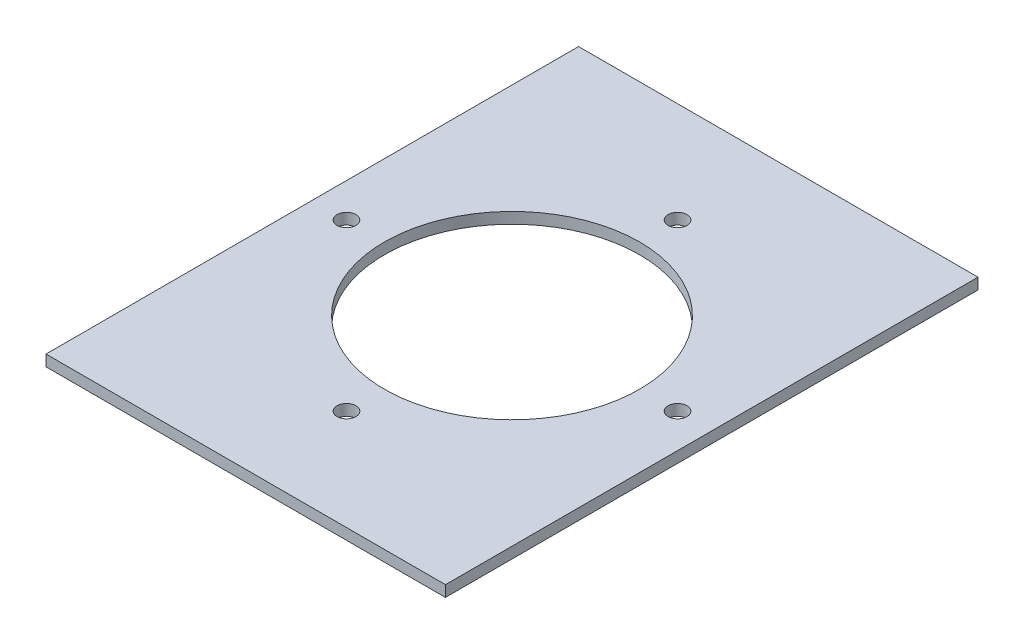
ISO-10303-21;
HEADER;
FILE_DESCRIPTION(('STEP AP214'),'2;1');
FILE_NAME('part.step','',(''),(''),'','','');
FILE_SCHEMA(('AUTOMOTIVE_DESIGN { 1 0 10303 214 1 1 1 1 }'));
ENDSEC;
DATA;
#1=APPLICATION_CONTEXT('core data for automotive mechanical design processes');
#2=APPLICATION_PROTOCOL_DEFINITION('international standard','automotive_design',2000,#1);
#3=PRODUCT_CONTEXT('',#1,'mechanical');
#4=PRODUCT('Part','Part','',(#3));
#5=PRODUCT_RELATED_PRODUCT_CATEGORY('part','',(#4));
#6=PRODUCT_DEFINITION_FORMATION('','',#4);
#7=PRODUCT_DEFINITION_CONTEXT('part definition',#1,'design');
#8=PRODUCT_DEFINITION('design','',#6,#7);
#9=PRODUCT_DEFINITION_SHAPE('','',#8);
#10=(LENGTH_UNIT() NAMED_UNIT(*) SI_UNIT(.MILLI.,.METRE.));
#11=(NAMED_UNIT(*) PLANE_ANGLE_UNIT() SI_UNIT($,.RADIAN.));
#12=(NAMED_UNIT(*) SI_UNIT($,.STERADIAN.) SOLID_ANGLE_UNIT());
#13=UNCERTAINTY_MEASURE_WITH_UNIT(LENGTH_MEASURE(1.E-05),#10,'distance_accuracy_value','');
#14=(GEOMETRIC_REPRESENTATION_CONTEXT(3) GLOBAL_UNCERTAINTY_ASSIGNED_CONTEXT((#13)) GLOBAL_UNIT_ASSIGNED_CONTEXT((#10,
#11,#12)) REPRESENTATION_CONTEXT('',''));
#15=CARTESIAN_POINT('',(0.,0.,0.));
#16=DIRECTION('',(0.,0.,1.));
#17=DIRECTION('',(1.,0.,0.));
#18=AXIS2_PLACEMENT_3D('',#15,#16,#17);
#19=CARTESIAN_POINT('',(0.,5.,0.));
#20=DIRECTION('',(0.,-1.,0.));
#21=DIRECTION('',(0.,0.,-1.));
#22=AXIS2_PLACEMENT_3D('',#19,#20,#21);
#23=PLANE('',#22);
#24=CARTESIAN_POINT('',(0.,5.,0.));
#25=DIRECTION('',(0.,-1.,0.));
#26=DIRECTION('',(0.,0.,-1.));
#27=AXIS2_PLACEMENT_3D('',#24,#25,#26);
#28=CIRCLE('',#27,57.5);
#29=CARTESIAN_POINT('',(0.,5.,-57.5));
#30=VERTEX_POINT('',#29);
#31=EDGE_CURVE('E114',#30,#30,#28,.F.);
#32=ORIENTED_EDGE('',*,*,#31,.F.);
#33=EDGE_LOOP('',(#32));
#34=FACE_BOUND('',#33,.T.);
#35=CARTESIAN_POINT('',(0.,5.,-74.6));
#36=DIRECTION('',(0.,-1.,0.));
#37=DIRECTION('',(0.,0.,-1.));
#38=AXIS2_PLACEMENT_3D('',#35,#36,#37);
#39=CIRCLE('',#38,4.25000000000001);
#40=CARTESIAN_POINT('',(0.,5.,-78.85));
#41=VERTEX_POINT('',#40);
#42=EDGE_CURVE('E137',#41,#41,#39,.F.);
#43=ORIENTED_EDGE('',*,*,#42,.F.);
#44=EDGE_LOOP('',(#43));
#45=FACE_BOUND('',#44,.T.);
#46=DIRECTION('',(0.,0.,1.));
#47=VECTOR('',#46,1.);
#48=CARTESIAN_POINT('',(-90.,5.,120.));
#49=LINE('',#48,#47);
#50=CARTESIAN_POINT('',(-90.,5.,-120.));
#51=VERTEX_POINT('',#50);
#52=CARTESIAN_POINT('',(-90.,5.,120.));
#53=VERTEX_POINT('',#52);
#54=EDGE_CURVE('E93',#51,#53,#49,.T.);
#55=ORIENTED_EDGE('',*,*,#54,.T.);
#56=DIRECTION('',(1.,0.,0.));
#57=VECTOR('',#56,1.);
#58=CARTESIAN_POINT('',(-90.,5.,120.));
#59=LINE('',#58,#57);
#60=CARTESIAN_POINT('',(90.,5.,120.));
#61=VERTEX_POINT('',#60);
#62=EDGE_CURVE('E88',#53,#61,#59,.T.);
#63=ORIENTED_EDGE('',*,*,#62,.T.);
#64=DIRECTION('',(0.,0.,-1.));
#65=VECTOR('',#64,1.);
#66=CARTESIAN_POINT('',(90.,5.,120.));
#67=LINE('',#66,#65);
#68=CARTESIAN_POINT('',(90.,5.,-120.));
#69=VERTEX_POINT('',#68);
#70=EDGE_CURVE('E91',#61,#69,#67,.T.);
#71=ORIENTED_EDGE('',*,*,#70,.T.);
#72=DIRECTION('',(-1.,0.,0.));
#73=VECTOR('',#72,1.);
#74=CARTESIAN_POINT('',(-90.,5.,-120.));
#75=LINE('',#74,#73);
#76=EDGE_CURVE('E58',#69,#51,#75,.T.);
#77=ORIENTED_EDGE('',*,*,#76,.T.);
#78=EDGE_LOOP('',(#55,#63,#71,#77));
#79=FACE_BOUND('',#78,.T.);
#80=CARTESIAN_POINT('',(0.,5.,74.6));
#81=DIRECTION('',(0.,-1.,0.));
#82=DIRECTION('',(0.,0.,-1.));
#83=AXIS2_PLACEMENT_3D('',#80,#81,#82);
#84=CIRCLE('',#83,4.25000000000001);
#85=CARTESIAN_POINT('',(0.,5.,70.35));
#86=VERTEX_POINT('',#85);
#87=EDGE_CURVE('E157',#86,#86,#84,.F.);
#88=ORIENTED_EDGE('',*,*,#87,.F.);
#89=EDGE_LOOP('',(#88));
#90=FACE_BOUND('',#89,.T.);
#91=CARTESIAN_POINT('',(-74.6,5.,2.60464507877698E-13));
#92=DIRECTION('',(0.,-1.,0.));
#93=DIRECTION('',(0.,0.,-1.));
#94=AXIS2_PLACEMENT_3D('',#91,#92,#93);
#95=CIRCLE('',#94,4.25000000000001);
#96=CARTESIAN_POINT('',(-74.6,5.,-4.24999999999975));
#97=VERTEX_POINT('',#96);
#98=EDGE_CURVE('E153',#97,#97,#95,.F.);
#99=ORIENTED_EDGE('',*,*,#98,.F.);
#100=EDGE_LOOP('',(#99));
#101=FACE_BOUND('',#100,.T.);
#102=CARTESIAN_POINT('',(74.6,5.,-7.81393523633093E-13));
#103=DIRECTION('',(0.,-1.,0.));
#104=DIRECTION('',(0.,0.,-1.));
#105=AXIS2_PLACEMENT_3D('',#102,#103,#104);
#106=CIRCLE('',#105,4.25000000000001);
#107=CARTESIAN_POINT('',(74.6,5.,-4.25000000000079));
#108=VERTEX_POINT('',#107);
#109=EDGE_CURVE('E146',#108,#108,#106,.F.);
#110=ORIENTED_EDGE('',*,*,#109,.F.);
#111=EDGE_LOOP('',(#110));
#112=FACE_BOUND('',#111,.T.);
#113=ADVANCED_FACE('F40',(#34,#45,#79,#90,#101,#112),#23,.F.);
#114=CARTESIAN_POINT('',(0.,0.,0.));
#115=DIRECTION('',(0.,-1.,0.));
#116=DIRECTION('',(0.,0.,-1.));
#117=AXIS2_PLACEMENT_3D('',#114,#115,#116);
#118=PLANE('',#117);
#119=CARTESIAN_POINT('',(-74.6,0.,2.60464507877698E-13));
#120=DIRECTION('',(0.,1.,0.));
#121=DIRECTION('',(1.,0.,0.));
#122=AXIS2_PLACEMENT_3D('',#119,#120,#121);
#123=CIRCLE('',#122,4.25000000000001);
#124=CARTESIAN_POINT('',(-70.35,0.,2.45625712187614E-13));
#125=VERTEX_POINT('',#124);
#126=EDGE_CURVE('E161',#125,#125,#123,.T.);
#127=ORIENTED_EDGE('',*,*,#126,.T.);
#128=EDGE_LOOP('',(#127));
#129=FACE_BOUND('',#128,.T.);
#130=DIRECTION('',(0.,0.,1.));
#131=VECTOR('',#130,1.);
#132=CARTESIAN_POINT('',(-90.,0.,120.));
#133=LINE('',#132,#131);
#134=CARTESIAN_POINT('',(-90.,0.,-120.));
#135=VERTEX_POINT('',#134);
#136=CARTESIAN_POINT('',(-90.,0.,120.));
#137=VERTEX_POINT('',#136);
#138=EDGE_CURVE('E110',#135,#137,#133,.T.);
#139=ORIENTED_EDGE('',*,*,#138,.F.);
#140=DIRECTION('',(-1.,0.,0.));
#141=VECTOR('',#140,1.);
#142=CARTESIAN_POINT('',(-90.,0.,-120.));
#143=LINE('',#142,#141);
#144=CARTESIAN_POINT('',(90.,0.,-120.));
#145=VERTEX_POINT('',#144);
#146=EDGE_CURVE('E81',#145,#135,#143,.T.);
#147=ORIENTED_EDGE('',*,*,#146,.F.);
#148=DIRECTION('',(0.,0.,-1.));
#149=VECTOR('',#148,1.);
#150=CARTESIAN_POINT('',(90.,0.,120.));
#151=LINE('',#150,#149);
#152=CARTESIAN_POINT('',(90.,0.,120.));
#153=VERTEX_POINT('',#152);
#154=EDGE_CURVE('E75',#153,#145,#151,.T.);
#155=ORIENTED_EDGE('',*,*,#154,.F.);
#156=DIRECTION('',(1.,0.,0.));
#157=VECTOR('',#156,1.);
#158=CARTESIAN_POINT('',(-90.,0.,120.));
#159=LINE('',#158,#157);
#160=EDGE_CURVE('E98',#137,#153,#159,.T.);
#161=ORIENTED_EDGE('',*,*,#160,.F.);
#162=EDGE_LOOP('',(#139,#147,#155,#161));
#163=FACE_BOUND('',#162,.T.);
#164=CARTESIAN_POINT('',(0.,0.,-74.6));
#165=DIRECTION('',(0.,1.,0.));
#166=DIRECTION('',(0.,0.,1.));
#167=AXIS2_PLACEMENT_3D('',#164,#165,#166);
#168=CIRCLE('',#167,4.25000000000001);
#169=CARTESIAN_POINT('',(0.,0.,-70.35));
#170=VERTEX_POINT('',#169);
#171=EDGE_CURVE('E142',#170,#170,#168,.T.);
#172=ORIENTED_EDGE('',*,*,#171,.T.);
#173=EDGE_LOOP('',(#172));
#174=FACE_BOUND('',#173,.T.);
#175=CARTESIAN_POINT('',(0.,0.,0.));
#176=DIRECTION('',(0.,1.,0.));
#177=DIRECTION('',(0.,0.,1.));
#178=AXIS2_PLACEMENT_3D('',#175,#176,#177);
#179=CIRCLE('',#178,57.5);
#180=CARTESIAN_POINT('',(0.,0.,57.5));
#181=VERTEX_POINT('',#180);
#182=EDGE_CURVE('E141',#181,#181,#179,.T.);
#183=ORIENTED_EDGE('',*,*,#182,.T.);
#184=EDGE_LOOP('',(#183));
#185=FACE_BOUND('',#184,.T.);
#186=CARTESIAN_POINT('',(0.,0.,74.6));
#187=DIRECTION('',(0.,1.,0.));
#188=DIRECTION('',(0.,0.,-1.));
#189=AXIS2_PLACEMENT_3D('',#186,#187,#188);
#190=CIRCLE('',#189,4.25000000000001);
#191=CARTESIAN_POINT('',(0.,0.,70.35));
#192=VERTEX_POINT('',#191);
#193=EDGE_CURVE('E166',#192,#192,#190,.T.);
#194=ORIENTED_EDGE('',*,*,#193,.T.);
#195=EDGE_LOOP('',(#194));
#196=FACE_BOUND('',#195,.T.);
#197=CARTESIAN_POINT('',(74.6,0.,-7.81393523633093E-13));
#198=DIRECTION('',(0.,1.,0.));
#199=DIRECTION('',(-1.,0.,0.));
#200=AXIS2_PLACEMENT_3D('',#197,#198,#199);
#201=CIRCLE('',#200,4.25000000000001);
#202=CARTESIAN_POINT('',(70.35,0.,-7.36877136562843E-13));
#203=VERTEX_POINT('',#202);
#204=EDGE_CURVE('E162',#203,#203,#201,.T.);
#205=ORIENTED_EDGE('',*,*,#204,.T.);
#206=EDGE_LOOP('',(#205));
#207=FACE_BOUND('',#206,.T.);
#208=ADVANCED_FACE('F128',(#129,#163,#174,#185,#196,#207),#118,.T.);
#209=CARTESIAN_POINT('',(-90.,5.,120.));
#210=DIRECTION('',(1.,0.,0.));
#211=DIRECTION('',(0.,0.,-1.));
#212=AXIS2_PLACEMENT_3D('',#209,#210,#211);
#213=PLANE('',#212);
#214=ORIENTED_EDGE('',*,*,#138,.T.);
#215=DIRECTION('',(0.,-1.,0.));
#216=VECTOR('',#215,1.);
#217=CARTESIAN_POINT('',(-90.,5.,120.));
#218=LINE('',#217,#216);
#219=EDGE_CURVE('E11',#53,#137,#218,.T.);
#220=ORIENTED_EDGE('',*,*,#219,.F.);
#221=ORIENTED_EDGE('',*,*,#54,.F.);
#222=DIRECTION('',(0.,-1.,0.));
#223=VECTOR('',#222,1.);
#224=CARTESIAN_POINT('',(-90.,5.,-120.));
#225=LINE('',#224,#223);
#226=EDGE_CURVE('E106',#51,#135,#225,.T.);
#227=ORIENTED_EDGE('',*,*,#226,.T.);
#228=EDGE_LOOP('',(#214,#220,#221,#227));
#229=FACE_BOUND('',#228,.T.);
#230=ADVANCED_FACE('F42',(#229),#213,.F.);
#231=CARTESIAN_POINT('',(-90.,5.,120.));
#232=DIRECTION('',(0.,0.,-1.));
#233=DIRECTION('',(-1.,0.,0.));
#234=AXIS2_PLACEMENT_3D('',#231,#232,#233);
#235=PLANE('',#234);
#236=ORIENTED_EDGE('',*,*,#160,.T.);
#237=DIRECTION('',(0.,-1.,0.));
#238=VECTOR('',#237,1.);
#239=CARTESIAN_POINT('',(90.,5.,120.));
#240=LINE('',#239,#238);
#241=EDGE_CURVE('E50',#61,#153,#240,.T.);
#242=ORIENTED_EDGE('',*,*,#241,.F.);
#243=ORIENTED_EDGE('',*,*,#62,.F.);
#244=ORIENTED_EDGE('',*,*,#219,.T.);
#245=EDGE_LOOP('',(#236,#242,#243,#244));
#246=FACE_BOUND('',#245,.T.);
#247=ADVANCED_FACE('F97',(#246),#235,.F.);
#248=CARTESIAN_POINT('',(90.,5.,120.));
#249=DIRECTION('',(-1.,0.,0.));
#250=DIRECTION('',(0.,0.,1.));
#251=AXIS2_PLACEMENT_3D('',#248,#249,#250);
#252=PLANE('',#251);
#253=ORIENTED_EDGE('',*,*,#154,.T.);
#254=DIRECTION('',(0.,-1.,0.));
#255=VECTOR('',#254,1.);
#256=CARTESIAN_POINT('',(90.,5.,-120.));
#257=LINE('',#256,#255);
#258=EDGE_CURVE('E100',#69,#145,#257,.T.);
#259=ORIENTED_EDGE('',*,*,#258,.F.);
#260=ORIENTED_EDGE('',*,*,#70,.F.);
#261=ORIENTED_EDGE('',*,*,#241,.T.);
#262=EDGE_LOOP('',(#253,#259,#260,#261));
#263=FACE_BOUND('',#262,.T.);
#264=ADVANCED_FACE('F101',(#263),#252,.F.);
#265=CARTESIAN_POINT('',(-90.,5.,-120.));
#266=DIRECTION('',(0.,0.,1.));
#267=DIRECTION('',(1.,0.,0.));
#268=AXIS2_PLACEMENT_3D('',#265,#266,#267);
#269=PLANE('',#268);
#270=ORIENTED_EDGE('',*,*,#146,.T.);
#271=ORIENTED_EDGE('',*,*,#226,.F.);
#272=ORIENTED_EDGE('',*,*,#76,.F.);
#273=ORIENTED_EDGE('',*,*,#258,.T.);
#274=EDGE_LOOP('',(#270,#271,#272,#273));
#275=FACE_BOUND('',#274,.T.);
#276=ADVANCED_FACE('F125',(#275),#269,.F.);
#277=CARTESIAN_POINT('',(0.,43.,-74.6));
#278=DIRECTION('',(0.,-1.,0.));
#279=DIRECTION('',(0.,0.,-1.));
#280=AXIS2_PLACEMENT_3D('',#277,#278,#279);
#281=CYLINDRICAL_SURFACE('',#280,4.25000000000001);
#282=ORIENTED_EDGE('',*,*,#171,.F.);
#283=EDGE_LOOP('',(#282));
#284=FACE_BOUND('',#283,.T.);
#285=ORIENTED_EDGE('',*,*,#42,.T.);
#286=EDGE_LOOP('',(#285));
#287=FACE_BOUND('',#286,.T.);
#288=ADVANCED_FACE('F205',(#284,#287),#281,.F.);
#289=CARTESIAN_POINT('',(0.,43.,0.));
#290=DIRECTION('',(0.,-1.,0.));
#291=DIRECTION('',(0.,0.,-1.));
#292=AXIS2_PLACEMENT_3D('',#289,#290,#291);
#293=CYLINDRICAL_SURFACE('',#292,57.5);
#294=ORIENTED_EDGE('',*,*,#182,.F.);
#295=EDGE_LOOP('',(#294));
#296=FACE_BOUND('',#295,.T.);
#297=ORIENTED_EDGE('',*,*,#31,.T.);
#298=EDGE_LOOP('',(#297));
#299=FACE_BOUND('',#298,.T.);
#300=ADVANCED_FACE('F181',(#296,#299),#293,.F.);
#301=CARTESIAN_POINT('',(0.,43.,74.6));
#302=DIRECTION('',(0.,-1.,0.));
#303=DIRECTION('',(0.,0.,-1.));
#304=AXIS2_PLACEMENT_3D('',#301,#302,#303);
#305=CYLINDRICAL_SURFACE('',#304,4.25000000000001);
#306=ORIENTED_EDGE('',*,*,#193,.F.);
#307=EDGE_LOOP('',(#306));
#308=FACE_BOUND('',#307,.T.);
#309=ORIENTED_EDGE('',*,*,#87,.T.);
#310=EDGE_LOOP('',(#309));
#311=FACE_BOUND('',#310,.T.);
#312=ADVANCED_FACE('F177',(#308,#311),#305,.F.);
#313=CARTESIAN_POINT('',(-74.6,43.,2.60464507877698E-13));
#314=DIRECTION('',(0.,-1.,0.));
#315=DIRECTION('',(0.,0.,-1.));
#316=AXIS2_PLACEMENT_3D('',#313,#314,#315);
#317=CYLINDRICAL_SURFACE('',#316,4.25000000000001);
#318=ORIENTED_EDGE('',*,*,#126,.F.);
#319=EDGE_LOOP('',(#318));
#320=FACE_BOUND('',#319,.T.);
#321=ORIENTED_EDGE('',*,*,#98,.T.);
#322=EDGE_LOOP('',(#321));
#323=FACE_BOUND('',#322,.T.);
#324=ADVANCED_FACE('F180',(#320,#323),#317,.F.);
#325=CARTESIAN_POINT('',(74.6,43.,-7.81393523633093E-13));
#326=DIRECTION('',(0.,-1.,0.));
#327=DIRECTION('',(0.,0.,-1.));
#328=AXIS2_PLACEMENT_3D('',#325,#326,#327);
#329=CYLINDRICAL_SURFACE('',#328,4.25000000000001);
#330=ORIENTED_EDGE('',*,*,#204,.F.);
#331=EDGE_LOOP('',(#330));
#332=FACE_BOUND('',#331,.T.);
#333=ORIENTED_EDGE('',*,*,#109,.T.);
#334=EDGE_LOOP('',(#333));
#335=FACE_BOUND('',#334,.T.);
#336=ADVANCED_FACE('F192',(#332,#335),#329,.F.);
#337=CLOSED_SHELL('',(#113,#208,#230,#247,#264,#276,#288,#300,#312,#324,#336));
#338=MANIFOLD_SOLID_BREP('B2',#337);
#339=ADVANCED_BREP_SHAPE_REPRESENTATION('',(#18,#338),#14);
#340=SHAPE_DEFINITION_REPRESENTATION(#9,#339);
ENDSEC;
END-ISO-10303-21;
